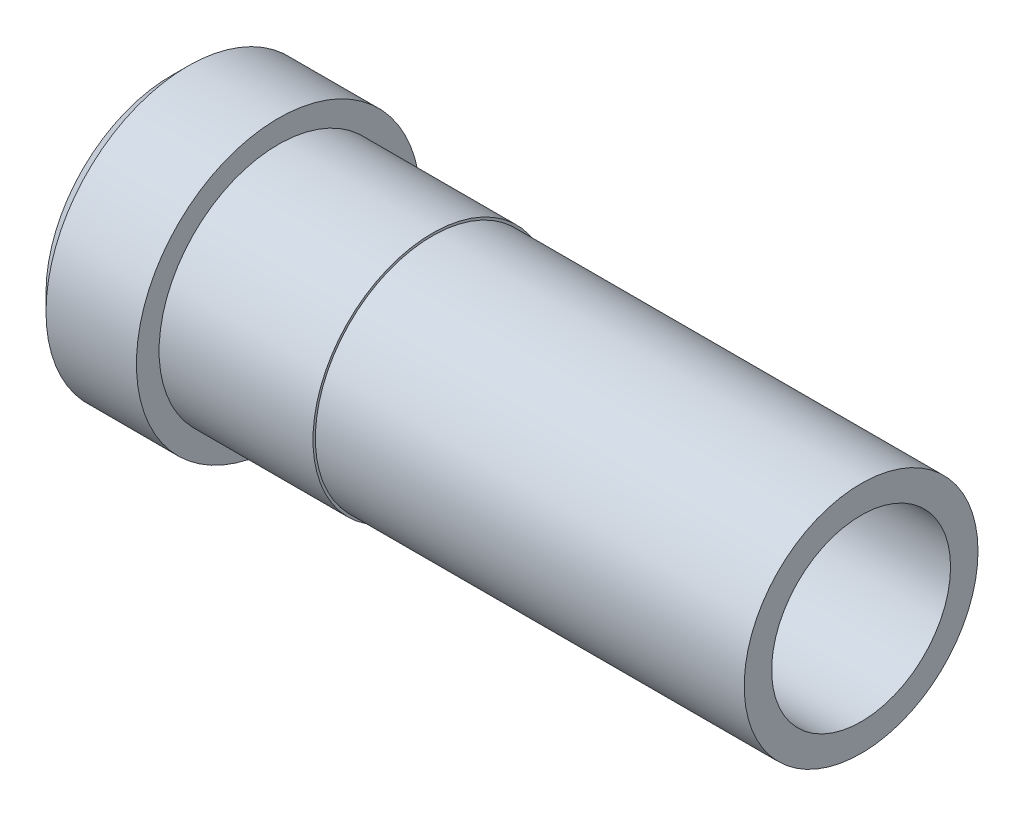
ISO-10303-21;
HEADER;
FILE_DESCRIPTION(('STEP AP214'),'2;1');
FILE_NAME('part.step','',(''),(''),'','','');
FILE_SCHEMA(('AUTOMOTIVE_DESIGN { 1 0 10303 214 1 1 1 1 }'));
ENDSEC;
DATA;
#1=APPLICATION_CONTEXT('core data for automotive mechanical design processes');
#2=APPLICATION_PROTOCOL_DEFINITION('international standard','automotive_design',2000,#1);
#3=PRODUCT_CONTEXT('',#1,'mechanical');
#4=PRODUCT('Part','Part','',(#3));
#5=PRODUCT_RELATED_PRODUCT_CATEGORY('part','',(#4));
#6=PRODUCT_DEFINITION_FORMATION('','',#4);
#7=PRODUCT_DEFINITION_CONTEXT('part definition',#1,'design');
#8=PRODUCT_DEFINITION('design','',#6,#7);
#9=PRODUCT_DEFINITION_SHAPE('','',#8);
#10=(LENGTH_UNIT() NAMED_UNIT(*) SI_UNIT(.MILLI.,.METRE.));
#11=(NAMED_UNIT(*) PLANE_ANGLE_UNIT() SI_UNIT($,.RADIAN.));
#12=(NAMED_UNIT(*) SI_UNIT($,.STERADIAN.) SOLID_ANGLE_UNIT());
#13=UNCERTAINTY_MEASURE_WITH_UNIT(LENGTH_MEASURE(1.E-05),#10,'distance_accuracy_value','');
#14=(GEOMETRIC_REPRESENTATION_CONTEXT(3) GLOBAL_UNCERTAINTY_ASSIGNED_CONTEXT((#13)) GLOBAL_UNIT_ASSIGNED_CONTEXT((#10,
#11,#12)) REPRESENTATION_CONTEXT('',''));
#15=CARTESIAN_POINT('',(0.,0.,0.));
#16=DIRECTION('',(0.,0.,1.));
#17=DIRECTION('',(1.,0.,0.));
#18=AXIS2_PLACEMENT_3D('',#15,#16,#17);
#19=CARTESIAN_POINT('',(-22.82825,6.35,0.));
#20=DIRECTION('',(1.,0.,0.));
#21=DIRECTION('',(0.,0.,-1.));
#22=AXIS2_PLACEMENT_3D('',#19,#20,#21);
#23=PLANE('',#22);
#24=CARTESIAN_POINT('',(-22.82825,0.,0.));
#25=DIRECTION('',(1.,0.,0.));
#26=DIRECTION('',(0.,0.,-1.));
#27=AXIS2_PLACEMENT_3D('',#24,#25,#26);
#28=CIRCLE('',#27,6.35);
#29=CARTESIAN_POINT('',(-22.82825,0.,-6.35));
#30=VERTEX_POINT('',#29);
#31=EDGE_CURVE('E25',#30,#30,#28,.T.);
#32=ORIENTED_EDGE('',*,*,#31,.T.);
#33=EDGE_LOOP('',(#32));
#34=FACE_BOUND('',#33,.T.);
#35=CARTESIAN_POINT('',(-22.82825,0.,0.));
#36=DIRECTION('',(1.,0.,0.));
#37=DIRECTION('',(0.,0.,-1.));
#38=AXIS2_PLACEMENT_3D('',#35,#36,#37);
#39=CIRCLE('',#38,6.223);
#40=CARTESIAN_POINT('',(-22.82825,0.,-6.223));
#41=VERTEX_POINT('',#40);
#42=EDGE_CURVE('E46',#41,#41,#39,.T.);
#43=ORIENTED_EDGE('',*,*,#42,.F.);
#44=EDGE_LOOP('',(#43));
#45=FACE_BOUND('',#44,.T.);
#46=ADVANCED_FACE('F14',(#34,#45),#23,.T.);
#47=CARTESIAN_POINT('',(0.,0.,0.));
#48=DIRECTION('',(1.,0.,0.));
#49=DIRECTION('',(0.,0.,-1.));
#50=AXIS2_PLACEMENT_3D('',#47,#48,#49);
#51=CYLINDRICAL_SURFACE('',#50,6.35);
#52=CARTESIAN_POINT('',(-31.01975,0.,0.));
#53=DIRECTION('',(1.,0.,0.));
#54=DIRECTION('',(0.,0.,-1.));
#55=AXIS2_PLACEMENT_3D('',#52,#53,#54);
#56=CIRCLE('',#55,6.35);
#57=CARTESIAN_POINT('',(-31.01975,0.,-6.35));
#58=VERTEX_POINT('',#57);
#59=EDGE_CURVE('E29',#58,#58,#56,.T.);
#60=ORIENTED_EDGE('',*,*,#59,.T.);
#61=EDGE_LOOP('',(#60));
#62=FACE_BOUND('',#61,.T.);
#63=ORIENTED_EDGE('',*,*,#31,.F.);
#64=EDGE_LOOP('',(#63));
#65=FACE_BOUND('',#64,.T.);
#66=ADVANCED_FACE('F54',(#62,#65),#51,.T.);
#67=CARTESIAN_POINT('',(-31.01975,7.5565,0.));
#68=DIRECTION('',(1.,0.,0.));
#69=DIRECTION('',(0.,0.,-1.));
#70=AXIS2_PLACEMENT_3D('',#67,#68,#69);
#71=PLANE('',#70);
#72=CARTESIAN_POINT('',(-31.01975,0.,0.));
#73=DIRECTION('',(1.,0.,0.));
#74=DIRECTION('',(0.,0.,-1.));
#75=AXIS2_PLACEMENT_3D('',#72,#73,#74);
#76=CIRCLE('',#75,7.5565);
#77=CARTESIAN_POINT('',(-31.01975,0.,-7.5565));
#78=VERTEX_POINT('',#77);
#79=EDGE_CURVE('E34',#78,#78,#76,.T.);
#80=ORIENTED_EDGE('',*,*,#79,.T.);
#81=EDGE_LOOP('',(#80));
#82=FACE_BOUND('',#81,.T.);
#83=ORIENTED_EDGE('',*,*,#59,.F.);
#84=EDGE_LOOP('',(#83));
#85=FACE_BOUND('',#84,.T.);
#86=ADVANCED_FACE('F61',(#82,#85),#71,.T.);
#87=CARTESIAN_POINT('',(0.,0.,0.));
#88=DIRECTION('',(1.,0.,0.));
#89=DIRECTION('',(0.,0.,-1.));
#90=AXIS2_PLACEMENT_3D('',#87,#88,#89);
#91=CYLINDRICAL_SURFACE('',#90,7.5565);
#92=CARTESIAN_POINT('',(-35.83305,0.,0.));
#93=DIRECTION('',(-1.,0.,0.));
#94=DIRECTION('',(0.,0.,1.));
#95=AXIS2_PLACEMENT_3D('',#92,#93,#94);
#96=CIRCLE('',#95,7.5565);
#97=CARTESIAN_POINT('',(-35.83305,0.,7.5565));
#98=VERTEX_POINT('',#97);
#99=EDGE_CURVE('E21',#98,#98,#96,.F.);
#100=ORIENTED_EDGE('',*,*,#99,.T.);
#101=EDGE_LOOP('',(#100));
#102=FACE_BOUND('',#101,.T.);
#103=ORIENTED_EDGE('',*,*,#79,.F.);
#104=EDGE_LOOP('',(#103));
#105=FACE_BOUND('',#104,.T.);
#106=ADVANCED_FACE('F67',(#102,#105),#91,.T.);
#107=CARTESIAN_POINT('',(-36.72205,4.7625,0.));
#108=DIRECTION('',(-1.,0.,0.));
#109=DIRECTION('',(0.,0.,1.));
#110=AXIS2_PLACEMENT_3D('',#107,#108,#109);
#111=PLANE('',#110);
#112=CARTESIAN_POINT('',(-36.72205,0.,0.));
#113=DIRECTION('',(-1.,0.,0.));
#114=DIRECTION('',(0.,0.,1.));
#115=AXIS2_PLACEMENT_3D('',#112,#113,#114);
#116=CIRCLE('',#115,6.6675);
#117=CARTESIAN_POINT('',(-36.72205,0.,6.6675));
#118=VERTEX_POINT('',#117);
#119=EDGE_CURVE('E10',#118,#118,#116,.T.);
#120=ORIENTED_EDGE('',*,*,#119,.T.);
#121=EDGE_LOOP('',(#120));
#122=FACE_BOUND('',#121,.T.);
#123=CARTESIAN_POINT('',(-36.72205,0.,0.));
#124=DIRECTION('',(1.,0.,0.));
#125=DIRECTION('',(0.,0.,-1.));
#126=AXIS2_PLACEMENT_3D('',#123,#124,#125);
#127=CIRCLE('',#126,4.7625);
#128=CARTESIAN_POINT('',(-36.72205,0.,-4.7625));
#129=VERTEX_POINT('',#128);
#130=EDGE_CURVE('E37',#129,#129,#127,.T.);
#131=ORIENTED_EDGE('',*,*,#130,.T.);
#132=EDGE_LOOP('',(#131));
#133=FACE_BOUND('',#132,.T.);
#134=ADVANCED_FACE('F71',(#122,#133),#111,.T.);
#135=CARTESIAN_POINT('',(0.,0.,0.));
#136=DIRECTION('',(1.,0.,0.));
#137=DIRECTION('',(0.,0.,-1.));
#138=AXIS2_PLACEMENT_3D('',#135,#136,#137);
#139=CYLINDRICAL_SURFACE('',#138,4.7625);
#140=CARTESIAN_POINT('',(0.,0.,0.));
#141=DIRECTION('',(1.,0.,0.));
#142=DIRECTION('',(0.,0.,-1.));
#143=AXIS2_PLACEMENT_3D('',#140,#141,#142);
#144=CIRCLE('',#143,4.7625);
#145=CARTESIAN_POINT('',(0.,0.,-4.7625));
#146=VERTEX_POINT('',#145);
#147=EDGE_CURVE('E40',#146,#146,#144,.T.);
#148=ORIENTED_EDGE('',*,*,#147,.T.);
#149=EDGE_LOOP('',(#148));
#150=FACE_BOUND('',#149,.T.);
#151=ORIENTED_EDGE('',*,*,#130,.F.);
#152=EDGE_LOOP('',(#151));
#153=FACE_BOUND('',#152,.T.);
#154=ADVANCED_FACE('F74',(#150,#153),#139,.F.);
#155=CARTESIAN_POINT('',(0.,6.223,0.));
#156=DIRECTION('',(1.,0.,0.));
#157=DIRECTION('',(0.,0.,-1.));
#158=AXIS2_PLACEMENT_3D('',#155,#156,#157);
#159=PLANE('',#158);
#160=CARTESIAN_POINT('',(0.,0.,0.));
#161=DIRECTION('',(1.,0.,0.));
#162=DIRECTION('',(0.,0.,-1.));
#163=AXIS2_PLACEMENT_3D('',#160,#161,#162);
#164=CIRCLE('',#163,6.223);
#165=CARTESIAN_POINT('',(0.,0.,-6.223));
#166=VERTEX_POINT('',#165);
#167=EDGE_CURVE('E43',#166,#166,#164,.T.);
#168=ORIENTED_EDGE('',*,*,#167,.T.);
#169=EDGE_LOOP('',(#168));
#170=FACE_BOUND('',#169,.T.);
#171=ORIENTED_EDGE('',*,*,#147,.F.);
#172=EDGE_LOOP('',(#171));
#173=FACE_BOUND('',#172,.T.);
#174=ADVANCED_FACE('F77',(#170,#173),#159,.T.);
#175=CARTESIAN_POINT('',(0.,0.,0.));
#176=DIRECTION('',(1.,0.,0.));
#177=DIRECTION('',(0.,0.,-1.));
#178=AXIS2_PLACEMENT_3D('',#175,#176,#177);
#179=CYLINDRICAL_SURFACE('',#178,6.223);
#180=ORIENTED_EDGE('',*,*,#42,.T.);
#181=EDGE_LOOP('',(#180));
#182=FACE_BOUND('',#181,.T.);
#183=ORIENTED_EDGE('',*,*,#167,.F.);
#184=EDGE_LOOP('',(#183));
#185=FACE_BOUND('',#184,.T.);
#186=ADVANCED_FACE('F50',(#182,#185),#179,.T.);
#187=CARTESIAN_POINT('',(-35.83305,0.,0.));
#188=DIRECTION('',(1.,0.,0.));
#189=DIRECTION('',(0.,0.,-1.));
#190=AXIS2_PLACEMENT_3D('',#187,#188,#189);
#191=CONICAL_SURFACE('',#190,7.5565,0.785398163397449);
#192=ORIENTED_EDGE('',*,*,#119,.F.);
#193=EDGE_LOOP('',(#192));
#194=FACE_BOUND('',#193,.T.);
#195=ORIENTED_EDGE('',*,*,#99,.F.);
#196=EDGE_LOOP('',(#195));
#197=FACE_BOUND('',#196,.T.);
#198=ADVANCED_FACE('F16',(#194,#197),#191,.T.);
#199=CLOSED_SHELL('',(#46,#66,#86,#106,#134,#154,#174,#186,#198));
#200=MANIFOLD_SOLID_BREP('B1',#199);
#201=ADVANCED_BREP_SHAPE_REPRESENTATION('',(#18,#200),#14);
#202=SHAPE_DEFINITION_REPRESENTATION(#9,#201);
ENDSEC;
END-ISO-10303-21;
